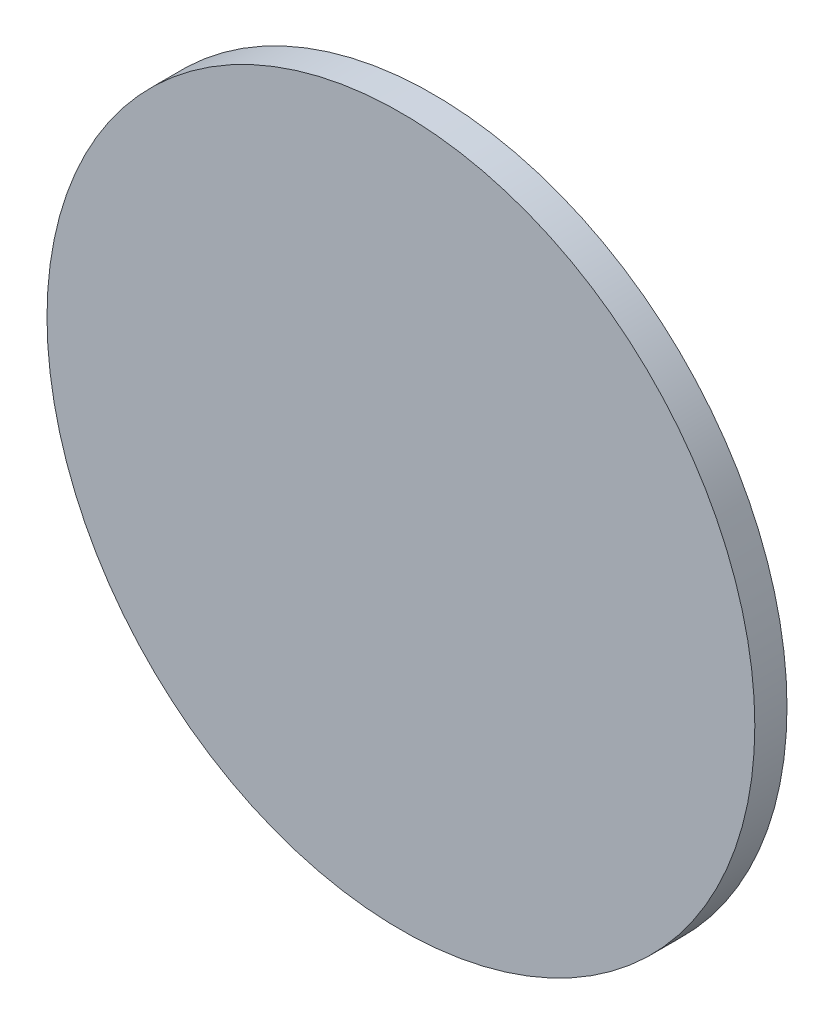
ISO-10303-21;
HEADER;
FILE_DESCRIPTION(('STEP AP214'),'2;1');
FILE_NAME('part.step','',(''),(''),'','','');
FILE_SCHEMA(('AUTOMOTIVE_DESIGN { 1 0 10303 214 1 1 1 1 }'));
ENDSEC;
DATA;
#1=APPLICATION_CONTEXT('core data for automotive mechanical design processes');
#2=APPLICATION_PROTOCOL_DEFINITION('international standard','automotive_design',2000,#1);
#3=PRODUCT_CONTEXT('',#1,'mechanical');
#4=PRODUCT('Part','Part','',(#3));
#5=PRODUCT_RELATED_PRODUCT_CATEGORY('part','',(#4));
#6=PRODUCT_DEFINITION_FORMATION('','',#4);
#7=PRODUCT_DEFINITION_CONTEXT('part definition',#1,'design');
#8=PRODUCT_DEFINITION('design','',#6,#7);
#9=PRODUCT_DEFINITION_SHAPE('','',#8);
#10=(LENGTH_UNIT() NAMED_UNIT(*) SI_UNIT(.MILLI.,.METRE.));
#11=(NAMED_UNIT(*) PLANE_ANGLE_UNIT() SI_UNIT($,.RADIAN.));
#12=(NAMED_UNIT(*) SI_UNIT($,.STERADIAN.) SOLID_ANGLE_UNIT());
#13=UNCERTAINTY_MEASURE_WITH_UNIT(LENGTH_MEASURE(1.E-05),#10,'distance_accuracy_value','');
#14=(GEOMETRIC_REPRESENTATION_CONTEXT(3) GLOBAL_UNCERTAINTY_ASSIGNED_CONTEXT((#13)) GLOBAL_UNIT_ASSIGNED_CONTEXT((#10,
#11,#12)) REPRESENTATION_CONTEXT('',''));
#15=CARTESIAN_POINT('',(0.,0.,0.));
#16=DIRECTION('',(0.,0.,1.));
#17=DIRECTION('',(1.,0.,0.));
#18=AXIS2_PLACEMENT_3D('',#15,#16,#17);
#19=CARTESIAN_POINT('',(0.,0.,0.));
#20=DIRECTION('',(0.,0.,1.));
#21=DIRECTION('',(0.,-1.,0.));
#22=AXIS2_PLACEMENT_3D('',#19,#20,#21);
#23=PLANE('',#22);
#24=CARTESIAN_POINT('',(0.,0.,0.));
#25=DIRECTION('',(0.,0.,-1.));
#26=DIRECTION('',(-1.,0.,0.));
#27=AXIS2_PLACEMENT_3D('',#24,#25,#26);
#28=CIRCLE('',#27,11.);
#29=CARTESIAN_POINT('',(-11.,0.,0.));
#30=VERTEX_POINT('',#29);
#31=EDGE_CURVE('E18',#30,#30,#28,.F.);
#32=ORIENTED_EDGE('',*,*,#31,.F.);
#33=EDGE_LOOP('',(#32));
#34=FACE_BOUND('',#33,.T.);
#35=ADVANCED_FACE('F15',(#34),#23,.F.);
#36=CARTESIAN_POINT('',(0.,0.,1.));
#37=DIRECTION('',(0.,0.,-1.));
#38=DIRECTION('',(-1.,0.,0.));
#39=AXIS2_PLACEMENT_3D('',#36,#37,#38);
#40=CYLINDRICAL_SURFACE('',#39,11.);
#41=ORIENTED_EDGE('',*,*,#31,.T.);
#42=EDGE_LOOP('',(#41));
#43=FACE_BOUND('',#42,.T.);
#44=CARTESIAN_POINT('',(0.,0.,1.));
#45=DIRECTION('',(0.,0.,-1.));
#46=DIRECTION('',(-1.,0.,0.));
#47=AXIS2_PLACEMENT_3D('',#44,#45,#46);
#48=CIRCLE('',#47,11.);
#49=CARTESIAN_POINT('',(-11.,0.,1.));
#50=VERTEX_POINT('',#49);
#51=EDGE_CURVE('E10',#50,#50,#48,.F.);
#52=ORIENTED_EDGE('',*,*,#51,.F.);
#53=EDGE_LOOP('',(#52));
#54=FACE_BOUND('',#53,.T.);
#55=ADVANCED_FACE('F27',(#43,#54),#40,.T.);
#56=CARTESIAN_POINT('',(0.,0.,1.));
#57=DIRECTION('',(0.,0.,1.));
#58=DIRECTION('',(0.,-1.,0.));
#59=AXIS2_PLACEMENT_3D('',#56,#57,#58);
#60=PLANE('',#59);
#61=ORIENTED_EDGE('',*,*,#51,.T.);
#62=EDGE_LOOP('',(#61));
#63=FACE_BOUND('',#62,.T.);
#64=ADVANCED_FACE('F35',(#63),#60,.T.);
#65=CLOSED_SHELL('',(#35,#55,#64));
#66=MANIFOLD_SOLID_BREP('B1',#65);
#67=ADVANCED_BREP_SHAPE_REPRESENTATION('',(#18,#66),#14);
#68=SHAPE_DEFINITION_REPRESENTATION(#9,#67);
ENDSEC;
END-ISO-10303-21;
